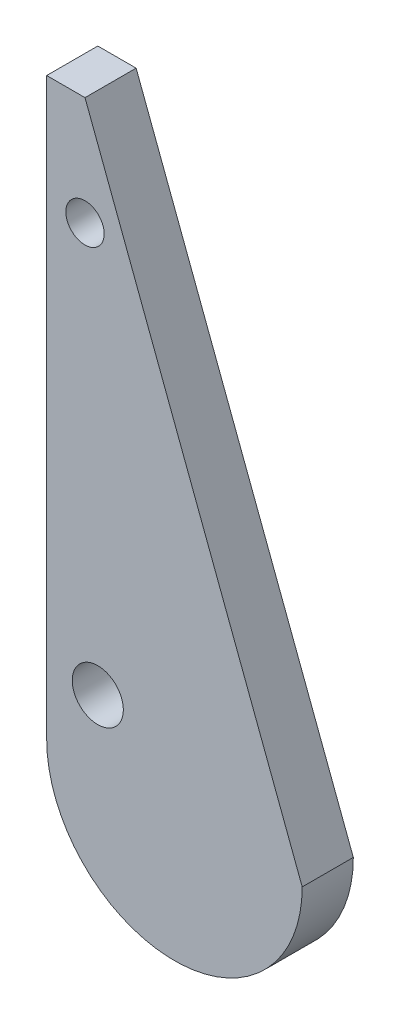
ISO-10303-21;
HEADER;
FILE_DESCRIPTION(('STEP AP214'),'2;1');
FILE_NAME('part.step','',(''),(''),'','','');
FILE_SCHEMA(('AUTOMOTIVE_DESIGN { 1 0 10303 214 1 1 1 1 }'));
ENDSEC;
DATA;
#1=APPLICATION_CONTEXT('core data for automotive mechanical design processes');
#2=APPLICATION_PROTOCOL_DEFINITION('international standard','automotive_design',2000,#1);
#3=PRODUCT_CONTEXT('',#1,'mechanical');
#4=PRODUCT('Part','Part','',(#3));
#5=PRODUCT_RELATED_PRODUCT_CATEGORY('part','',(#4));
#6=PRODUCT_DEFINITION_FORMATION('','',#4);
#7=PRODUCT_DEFINITION_CONTEXT('part definition',#1,'design');
#8=PRODUCT_DEFINITION('design','',#6,#7);
#9=PRODUCT_DEFINITION_SHAPE('','',#8);
#10=(LENGTH_UNIT() NAMED_UNIT(*) SI_UNIT(.MILLI.,.METRE.));
#11=(NAMED_UNIT(*) PLANE_ANGLE_UNIT() SI_UNIT($,.RADIAN.));
#12=(NAMED_UNIT(*) SI_UNIT($,.STERADIAN.) SOLID_ANGLE_UNIT());
#13=UNCERTAINTY_MEASURE_WITH_UNIT(LENGTH_MEASURE(1.E-05),#10,'distance_accuracy_value','');
#14=(GEOMETRIC_REPRESENTATION_CONTEXT(3) GLOBAL_UNCERTAINTY_ASSIGNED_CONTEXT((#13)) GLOBAL_UNIT_ASSIGNED_CONTEXT((#10,
#11,#12)) REPRESENTATION_CONTEXT('',''));
#15=CARTESIAN_POINT('',(0.,0.,0.));
#16=DIRECTION('',(0.,0.,1.));
#17=DIRECTION('',(1.,0.,0.));
#18=AXIS2_PLACEMENT_3D('',#15,#16,#17);
#19=CARTESIAN_POINT('',(10.,0.,4.));
#20=DIRECTION('',(0.,0.,-1.));
#21=DIRECTION('',(-1.,0.,0.));
#22=AXIS2_PLACEMENT_3D('',#19,#20,#21);
#23=CYLINDRICAL_SURFACE('',#22,10.);
#24=CARTESIAN_POINT('',(10.,0.,0.));
#25=DIRECTION('',(0.,0.,1.));
#26=DIRECTION('',(1.,0.,0.));
#27=AXIS2_PLACEMENT_3D('',#24,#25,#26);
#28=CIRCLE('',#27,10.);
#29=CARTESIAN_POINT('',(0.,0.,0.));
#30=VERTEX_POINT('',#29);
#31=CARTESIAN_POINT('',(20.,0.,0.));
#32=VERTEX_POINT('',#31);
#33=EDGE_CURVE('E96',#30,#32,#28,.T.);
#34=ORIENTED_EDGE('',*,*,#33,.T.);
#35=DIRECTION('',(0.,0.,-1.));
#36=VECTOR('',#35,1.);
#37=CARTESIAN_POINT('',(20.,0.,4.));
#38=LINE('',#37,#36);
#39=CARTESIAN_POINT('',(20.,0.,4.));
#40=VERTEX_POINT('',#39);
#41=EDGE_CURVE('E11',#40,#32,#38,.T.);
#42=ORIENTED_EDGE('',*,*,#41,.F.);
#43=CARTESIAN_POINT('',(10.,0.,4.));
#44=DIRECTION('',(0.,0.,1.));
#45=DIRECTION('',(1.,0.,0.));
#46=AXIS2_PLACEMENT_3D('',#43,#44,#45);
#47=CIRCLE('',#46,10.);
#48=CARTESIAN_POINT('',(0.,0.,4.));
#49=VERTEX_POINT('',#48);
#50=EDGE_CURVE('E84',#49,#40,#47,.T.);
#51=ORIENTED_EDGE('',*,*,#50,.F.);
#52=DIRECTION('',(0.,0.,-1.));
#53=VECTOR('',#52,1.);
#54=CARTESIAN_POINT('',(0.,0.,4.));
#55=LINE('',#54,#53);
#56=EDGE_CURVE('E92',#49,#30,#55,.T.);
#57=ORIENTED_EDGE('',*,*,#56,.T.);
#58=EDGE_LOOP('',(#34,#42,#51,#57));
#59=FACE_BOUND('',#58,.T.);
#60=ADVANCED_FACE('F33',(#59),#23,.T.);
#61=CARTESIAN_POINT('',(3.,45.,4.));
#62=DIRECTION('',(-0.935472093666821,-0.353400568718577,0.));
#63=DIRECTION('',(0.353400568718577,-0.935472093666822,0.));
#64=AXIS2_PLACEMENT_3D('',#61,#62,#63);
#65=PLANE('',#64);
#66=DIRECTION('',(-0.353400568718577,0.935472093666821,0.));
#67=VECTOR('',#66,1.);
#68=CARTESIAN_POINT('',(3.,45.,0.));
#69=LINE('',#68,#67);
#70=CARTESIAN_POINT('',(3.,45.,0.));
#71=VERTEX_POINT('',#70);
#72=EDGE_CURVE('E88',#32,#71,#69,.T.);
#73=ORIENTED_EDGE('',*,*,#72,.T.);
#74=DIRECTION('',(0.,0.,-1.));
#75=VECTOR('',#74,1.);
#76=CARTESIAN_POINT('',(3.,45.,4.));
#77=LINE('',#76,#75);
#78=CARTESIAN_POINT('',(3.,45.,4.));
#79=VERTEX_POINT('',#78);
#80=EDGE_CURVE('E41',#79,#71,#77,.T.);
#81=ORIENTED_EDGE('',*,*,#80,.F.);
#82=DIRECTION('',(-0.353400568718577,0.935472093666821,0.));
#83=VECTOR('',#82,1.);
#84=CARTESIAN_POINT('',(3.,45.,4.));
#85=LINE('',#84,#83);
#86=EDGE_CURVE('E79',#40,#79,#85,.T.);
#87=ORIENTED_EDGE('',*,*,#86,.F.);
#88=ORIENTED_EDGE('',*,*,#41,.T.);
#89=EDGE_LOOP('',(#73,#81,#87,#88));
#90=FACE_BOUND('',#89,.T.);
#91=ADVANCED_FACE('F87',(#90),#65,.F.);
#92=CARTESIAN_POINT('',(0.,45.,4.));
#93=DIRECTION('',(0.,-1.,0.));
#94=DIRECTION('',(0.,0.,-1.));
#95=AXIS2_PLACEMENT_3D('',#92,#93,#94);
#96=PLANE('',#95);
#97=DIRECTION('',(-1.,0.,0.));
#98=VECTOR('',#97,1.);
#99=CARTESIAN_POINT('',(0.,45.,0.));
#100=LINE('',#99,#98);
#101=CARTESIAN_POINT('',(0.,45.,0.));
#102=VERTEX_POINT('',#101);
#103=EDGE_CURVE('E66',#71,#102,#100,.T.);
#104=ORIENTED_EDGE('',*,*,#103,.T.);
#105=DIRECTION('',(0.,0.,-1.));
#106=VECTOR('',#105,1.);
#107=CARTESIAN_POINT('',(0.,45.,4.));
#108=LINE('',#107,#106);
#109=CARTESIAN_POINT('',(0.,45.,4.));
#110=VERTEX_POINT('',#109);
#111=EDGE_CURVE('E89',#110,#102,#108,.T.);
#112=ORIENTED_EDGE('',*,*,#111,.F.);
#113=DIRECTION('',(-1.,0.,0.));
#114=VECTOR('',#113,1.);
#115=CARTESIAN_POINT('',(0.,45.,4.));
#116=LINE('',#115,#114);
#117=EDGE_CURVE('E82',#79,#110,#116,.T.);
#118=ORIENTED_EDGE('',*,*,#117,.F.);
#119=ORIENTED_EDGE('',*,*,#80,.T.);
#120=EDGE_LOOP('',(#104,#112,#118,#119));
#121=FACE_BOUND('',#120,.T.);
#122=ADVANCED_FACE('F90',(#121),#96,.F.);
#123=CARTESIAN_POINT('',(0.,0.,4.));
#124=DIRECTION('',(1.,0.,0.));
#125=DIRECTION('',(0.,0.,-1.));
#126=AXIS2_PLACEMENT_3D('',#123,#124,#125);
#127=PLANE('',#126);
#128=DIRECTION('',(0.,-1.,0.));
#129=VECTOR('',#128,1.);
#130=CARTESIAN_POINT('',(0.,0.,0.));
#131=LINE('',#130,#129);
#132=EDGE_CURVE('E72',#102,#30,#131,.T.);
#133=ORIENTED_EDGE('',*,*,#132,.T.);
#134=ORIENTED_EDGE('',*,*,#56,.F.);
#135=DIRECTION('',(0.,-1.,0.));
#136=VECTOR('',#135,1.);
#137=CARTESIAN_POINT('',(0.,0.,4.));
#138=LINE('',#137,#136);
#139=EDGE_CURVE('E49',#110,#49,#138,.T.);
#140=ORIENTED_EDGE('',*,*,#139,.F.);
#141=ORIENTED_EDGE('',*,*,#111,.T.);
#142=EDGE_LOOP('',(#133,#134,#140,#141));
#143=FACE_BOUND('',#142,.T.);
#144=ADVANCED_FACE('F104',(#143),#127,.F.);
#145=CARTESIAN_POINT('',(10.,0.,4.));
#146=DIRECTION('',(0.,0.,1.));
#147=DIRECTION('',(1.,0.,0.));
#148=AXIS2_PLACEMENT_3D('',#145,#146,#147);
#149=PLANE('',#148);
#150=CARTESIAN_POINT('',(4.,5.,4.));
#151=DIRECTION('',(0.,0.,1.));
#152=DIRECTION('',(1.,0.,0.));
#153=AXIS2_PLACEMENT_3D('',#150,#151,#152);
#154=CIRCLE('',#153,2.);
#155=CARTESIAN_POINT('',(6.,5.,4.));
#156=VERTEX_POINT('',#155);
#157=EDGE_CURVE('E116',#156,#156,#154,.T.);
#158=ORIENTED_EDGE('',*,*,#157,.F.);
#159=EDGE_LOOP('',(#158));
#160=FACE_BOUND('',#159,.T.);
#161=CARTESIAN_POINT('',(3.,36.5110493147254,4.));
#162=DIRECTION('',(0.,0.,1.));
#163=DIRECTION('',(1.,0.,0.));
#164=AXIS2_PLACEMENT_3D('',#161,#162,#163);
#165=CIRCLE('',#164,1.5);
#166=CARTESIAN_POINT('',(4.5,36.5110493147254,4.));
#167=VERTEX_POINT('',#166);
#168=EDGE_CURVE('E110',#167,#167,#165,.T.);
#169=ORIENTED_EDGE('',*,*,#168,.F.);
#170=EDGE_LOOP('',(#169));
#171=FACE_BOUND('',#170,.T.);
#172=ORIENTED_EDGE('',*,*,#50,.T.);
#173=ORIENTED_EDGE('',*,*,#86,.T.);
#174=ORIENTED_EDGE('',*,*,#117,.T.);
#175=ORIENTED_EDGE('',*,*,#139,.T.);
#176=EDGE_LOOP('',(#172,#173,#174,#175));
#177=FACE_BOUND('',#176,.T.);
#178=ADVANCED_FACE('F80',(#160,#171,#177),#149,.T.);
#179=CARTESIAN_POINT('',(10.,0.,0.));
#180=DIRECTION('',(0.,0.,1.));
#181=DIRECTION('',(1.,0.,0.));
#182=AXIS2_PLACEMENT_3D('',#179,#180,#181);
#183=PLANE('',#182);
#184=CARTESIAN_POINT('',(4.,5.,0.));
#185=DIRECTION('',(0.,0.,1.));
#186=DIRECTION('',(1.,0.,0.));
#187=AXIS2_PLACEMENT_3D('',#184,#185,#186);
#188=CIRCLE('',#187,2.);
#189=CARTESIAN_POINT('',(6.,5.,0.));
#190=VERTEX_POINT('',#189);
#191=EDGE_CURVE('E99',#190,#190,#188,.T.);
#192=ORIENTED_EDGE('',*,*,#191,.T.);
#193=EDGE_LOOP('',(#192));
#194=FACE_BOUND('',#193,.T.);
#195=CARTESIAN_POINT('',(3.,36.5110493147254,0.));
#196=DIRECTION('',(0.,0.,1.));
#197=DIRECTION('',(1.,0.,0.));
#198=AXIS2_PLACEMENT_3D('',#195,#196,#197);
#199=CIRCLE('',#198,1.5);
#200=CARTESIAN_POINT('',(4.5,36.5110493147254,0.));
#201=VERTEX_POINT('',#200);
#202=EDGE_CURVE('E113',#201,#201,#199,.T.);
#203=ORIENTED_EDGE('',*,*,#202,.T.);
#204=EDGE_LOOP('',(#203));
#205=FACE_BOUND('',#204,.T.);
#206=ORIENTED_EDGE('',*,*,#33,.F.);
#207=ORIENTED_EDGE('',*,*,#132,.F.);
#208=ORIENTED_EDGE('',*,*,#103,.F.);
#209=ORIENTED_EDGE('',*,*,#72,.F.);
#210=EDGE_LOOP('',(#206,#207,#208,#209));
#211=FACE_BOUND('',#210,.T.);
#212=ADVANCED_FACE('F107',(#194,#205,#211),#183,.F.);
#213=CARTESIAN_POINT('',(3.,36.5110493147254,0.));
#214=DIRECTION('',(0.,0.,1.));
#215=DIRECTION('',(1.,0.,0.));
#216=AXIS2_PLACEMENT_3D('',#213,#214,#215);
#217=CYLINDRICAL_SURFACE('',#216,1.5);
#218=ORIENTED_EDGE('',*,*,#202,.F.);
#219=EDGE_LOOP('',(#218));
#220=FACE_BOUND('',#219,.T.);
#221=ORIENTED_EDGE('',*,*,#168,.T.);
#222=EDGE_LOOP('',(#221));
#223=FACE_BOUND('',#222,.T.);
#224=ADVANCED_FACE('F127',(#220,#223),#217,.F.);
#225=CARTESIAN_POINT('',(4.,5.,0.));
#226=DIRECTION('',(0.,0.,1.));
#227=DIRECTION('',(1.,0.,0.));
#228=AXIS2_PLACEMENT_3D('',#225,#226,#227);
#229=CYLINDRICAL_SURFACE('',#228,2.);
#230=ORIENTED_EDGE('',*,*,#191,.F.);
#231=EDGE_LOOP('',(#230));
#232=FACE_BOUND('',#231,.T.);
#233=ORIENTED_EDGE('',*,*,#157,.T.);
#234=EDGE_LOOP('',(#233));
#235=FACE_BOUND('',#234,.T.);
#236=ADVANCED_FACE('F124',(#232,#235),#229,.F.);
#237=CLOSED_SHELL('',(#60,#91,#122,#144,#178,#212,#224,#236));
#238=MANIFOLD_SOLID_BREP('B2',#237);
#239=ADVANCED_BREP_SHAPE_REPRESENTATION('',(#18,#238),#14);
#240=SHAPE_DEFINITION_REPRESENTATION(#9,#239);
ENDSEC;
END-ISO-10303-21;
